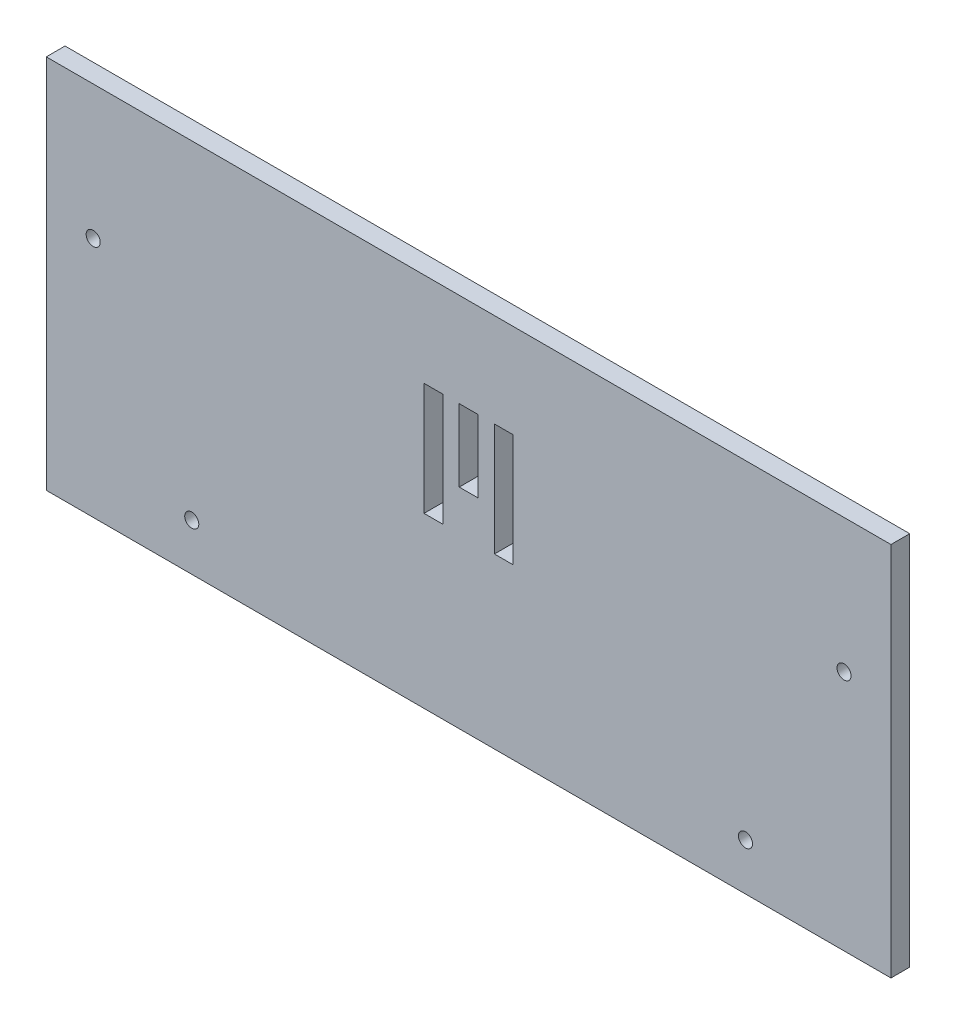
ISO-10303-21;
HEADER;
FILE_DESCRIPTION(('STEP AP214'),'2;1');
FILE_NAME('part.step','',(''),(''),'','','');
FILE_SCHEMA(('AUTOMOTIVE_DESIGN { 1 0 10303 214 1 1 1 1 }'));
ENDSEC;
DATA;
#1=APPLICATION_CONTEXT('core data for automotive mechanical design processes');
#2=APPLICATION_PROTOCOL_DEFINITION('international standard','automotive_design',2000,#1);
#3=PRODUCT_CONTEXT('',#1,'mechanical');
#4=PRODUCT('Part','Part','',(#3));
#5=PRODUCT_RELATED_PRODUCT_CATEGORY('part','',(#4));
#6=PRODUCT_DEFINITION_FORMATION('','',#4);
#7=PRODUCT_DEFINITION_CONTEXT('part definition',#1,'design');
#8=PRODUCT_DEFINITION('design','',#6,#7);
#9=PRODUCT_DEFINITION_SHAPE('','',#8);
#10=(LENGTH_UNIT() NAMED_UNIT(*) SI_UNIT(.MILLI.,.METRE.));
#11=(NAMED_UNIT(*) PLANE_ANGLE_UNIT() SI_UNIT($,.RADIAN.));
#12=(NAMED_UNIT(*) SI_UNIT($,.STERADIAN.) SOLID_ANGLE_UNIT());
#13=UNCERTAINTY_MEASURE_WITH_UNIT(LENGTH_MEASURE(1.E-05),#10,'distance_accuracy_value','');
#14=(GEOMETRIC_REPRESENTATION_CONTEXT(3) GLOBAL_UNCERTAINTY_ASSIGNED_CONTEXT((#13)) GLOBAL_UNIT_ASSIGNED_CONTEXT((#10,
#11,#12)) REPRESENTATION_CONTEXT('',''));
#15=CARTESIAN_POINT('',(0.,0.,0.));
#16=DIRECTION('',(0.,0.,1.));
#17=DIRECTION('',(1.,0.,0.));
#18=AXIS2_PLACEMENT_3D('',#15,#16,#17);
#19=CARTESIAN_POINT('',(0.,0.,4.));
#20=DIRECTION('',(0.,0.,1.));
#21=DIRECTION('',(1.,0.,0.));
#22=AXIS2_PLACEMENT_3D('',#19,#20,#21);
#23=PLANE('',#22);
#24=DIRECTION('',(0.,-1.,0.));
#25=VECTOR('',#24,1.);
#26=CARTESIAN_POINT('',(8.20064205457466,-1.11712598425197,4.));
#27=LINE('',#26,#25);
#28=CARTESIAN_POINT('',(8.20064205457466,-1.11712598425197,4.));
#29=VERTEX_POINT('',#28);
#30=CARTESIAN_POINT('',(8.20064205457466,-25.117125984252,4.));
#31=VERTEX_POINT('',#30);
#32=EDGE_CURVE('E48',#29,#31,#27,.T.);
#33=ORIENTED_EDGE('',*,*,#32,.F.);
#34=DIRECTION('',(-1.,0.,0.));
#35=VECTOR('',#34,1.);
#36=CARTESIAN_POINT('',(8.20064205457466,-1.11712598425197,4.));
#37=LINE('',#36,#35);
#38=CARTESIAN_POINT('',(12.2006420545746,-1.11712598425197,4.));
#39=VERTEX_POINT('',#38);
#40=EDGE_CURVE('E164',#39,#29,#37,.T.);
#41=ORIENTED_EDGE('',*,*,#40,.F.);
#42=DIRECTION('',(0.,1.,0.));
#43=VECTOR('',#42,1.);
#44=CARTESIAN_POINT('',(12.2006420545746,-1.11712598425197,4.));
#45=LINE('',#44,#43);
#46=CARTESIAN_POINT('',(12.2006420545746,-25.117125984252,4.));
#47=VERTEX_POINT('',#46);
#48=EDGE_CURVE('E167',#47,#39,#45,.T.);
#49=ORIENTED_EDGE('',*,*,#48,.F.);
#50=DIRECTION('',(1.,0.,0.));
#51=VECTOR('',#50,1.);
#52=CARTESIAN_POINT('',(8.20064205457466,-25.117125984252,4.));
#53=LINE('',#52,#51);
#54=EDGE_CURVE('E173',#31,#47,#53,.T.);
#55=ORIENTED_EDGE('',*,*,#54,.F.);
#56=EDGE_LOOP('',(#33,#41,#49,#55));
#57=FACE_BOUND('',#56,.T.);
#58=DIRECTION('',(0.,-1.,0.));
#59=VECTOR('',#58,1.);
#60=CARTESIAN_POINT('',(0.700642054574652,-1.11712598425197,4.));
#61=LINE('',#60,#59);
#62=CARTESIAN_POINT('',(0.700642054574652,-1.11712598425197,4.));
#63=VERTEX_POINT('',#62);
#64=CARTESIAN_POINT('',(0.700642054574654,-16.517125984252,4.));
#65=VERTEX_POINT('',#64);
#66=EDGE_CURVE('E179',#63,#65,#61,.T.);
#67=ORIENTED_EDGE('',*,*,#66,.F.);
#68=DIRECTION('',(-1.,0.,0.));
#69=VECTOR('',#68,1.);
#70=CARTESIAN_POINT('',(0.700642054574652,-1.11712598425197,4.));
#71=LINE('',#70,#69);
#72=CARTESIAN_POINT('',(4.70064205457464,-1.11712598425197,4.));
#73=VERTEX_POINT('',#72);
#74=EDGE_CURVE('E187',#73,#63,#71,.T.);
#75=ORIENTED_EDGE('',*,*,#74,.F.);
#76=DIRECTION('',(0.,1.,0.));
#77=VECTOR('',#76,1.);
#78=CARTESIAN_POINT('',(4.70064205457464,-1.11712598425197,4.));
#79=LINE('',#78,#77);
#80=CARTESIAN_POINT('',(4.70064205457464,-16.517125984252,4.));
#81=VERTEX_POINT('',#80);
#82=EDGE_CURVE('E201',#81,#73,#79,.T.);
#83=ORIENTED_EDGE('',*,*,#82,.F.);
#84=DIRECTION('',(1.,0.,0.));
#85=VECTOR('',#84,1.);
#86=CARTESIAN_POINT('',(0.700642054574654,-16.517125984252,4.));
#87=LINE('',#86,#85);
#88=EDGE_CURVE('E198',#65,#81,#87,.T.);
#89=ORIENTED_EDGE('',*,*,#88,.F.);
#90=EDGE_LOOP('',(#67,#75,#83,#89));
#91=FACE_BOUND('',#90,.T.);
#92=DIRECTION('',(0.,-1.,0.));
#93=VECTOR('',#92,1.);
#94=CARTESIAN_POINT('',(-6.79935794542534,-1.11712598425197,4.));
#95=LINE('',#94,#93);
#96=CARTESIAN_POINT('',(-6.79935794542534,-1.11712598425197,4.));
#97=VERTEX_POINT('',#96);
#98=CARTESIAN_POINT('',(-6.79935794542534,-25.117125984252,4.));
#99=VERTEX_POINT('',#98);
#100=EDGE_CURVE('E208',#97,#99,#95,.T.);
#101=ORIENTED_EDGE('',*,*,#100,.F.);
#102=DIRECTION('',(-1.,0.,0.));
#103=VECTOR('',#102,1.);
#104=CARTESIAN_POINT('',(-6.79935794542534,-1.11712598425197,4.));
#105=LINE('',#104,#103);
#106=CARTESIAN_POINT('',(-2.79935794542536,-1.11712598425197,4.));
#107=VERTEX_POINT('',#106);
#108=EDGE_CURVE('E219',#107,#97,#105,.T.);
#109=ORIENTED_EDGE('',*,*,#108,.F.);
#110=DIRECTION('',(0.,1.,0.));
#111=VECTOR('',#110,1.);
#112=CARTESIAN_POINT('',(-2.79935794542536,-1.11712598425197,4.));
#113=LINE('',#112,#111);
#114=CARTESIAN_POINT('',(-2.79935794542536,-25.117125984252,4.));
#115=VERTEX_POINT('',#114);
#116=EDGE_CURVE('E233',#115,#107,#113,.T.);
#117=ORIENTED_EDGE('',*,*,#116,.F.);
#118=DIRECTION('',(1.,0.,0.));
#119=VECTOR('',#118,1.);
#120=CARTESIAN_POINT('',(-6.79935794542534,-25.117125984252,4.));
#121=LINE('',#120,#119);
#122=EDGE_CURVE('E230',#99,#115,#121,.T.);
#123=ORIENTED_EDGE('',*,*,#122,.F.);
#124=EDGE_LOOP('',(#101,#109,#117,#123));
#125=FACE_BOUND('',#124,.T.);
#126=CARTESIAN_POINT('',(61.7006420545747,-51.117125984252,4.));
#127=DIRECTION('',(0.,0.,1.));
#128=DIRECTION('',(1.,0.,0.));
#129=AXIS2_PLACEMENT_3D('',#126,#127,#128);
#130=CIRCLE('',#129,1.5);
#131=CARTESIAN_POINT('',(63.2006420545747,-51.117125984252,4.));
#132=VERTEX_POINT('',#131);
#133=EDGE_CURVE('E253',#132,#132,#130,.T.);
#134=ORIENTED_EDGE('',*,*,#133,.F.);
#135=EDGE_LOOP('',(#134));
#136=FACE_BOUND('',#135,.T.);
#137=CARTESIAN_POINT('',(-77.2993579454253,-9.61712598425197,4.));
#138=DIRECTION('',(0.,0.,1.));
#139=DIRECTION('',(1.,0.,0.));
#140=AXIS2_PLACEMENT_3D('',#137,#138,#139);
#141=CIRCLE('',#140,1.5);
#142=CARTESIAN_POINT('',(-75.7993579454253,-9.61712598425197,4.));
#143=VERTEX_POINT('',#142);
#144=EDGE_CURVE('E265',#143,#143,#141,.T.);
#145=ORIENTED_EDGE('',*,*,#144,.F.);
#146=EDGE_LOOP('',(#145));
#147=FACE_BOUND('',#146,.T.);
#148=DIRECTION('',(0.,-1.,0.));
#149=VECTOR('',#148,1.);
#150=CARTESIAN_POINT('',(-87.2993579454253,18.882874015748,4.));
#151=LINE('',#150,#149);
#152=CARTESIAN_POINT('',(-87.2993579454253,18.882874015748,4.));
#153=VERTEX_POINT('',#152);
#154=CARTESIAN_POINT('',(-87.2993579454253,-61.117125984252,4.));
#155=VERTEX_POINT('',#154);
#156=EDGE_CURVE('E271',#153,#155,#151,.T.);
#157=ORIENTED_EDGE('',*,*,#156,.T.);
#158=DIRECTION('',(1.,0.,0.));
#159=VECTOR('',#158,1.);
#160=CARTESIAN_POINT('',(-87.2993579454253,-61.117125984252,4.));
#161=LINE('',#160,#159);
#162=CARTESIAN_POINT('',(92.7006420545746,-61.117125984252,4.));
#163=VERTEX_POINT('',#162);
#164=EDGE_CURVE('E274',#155,#163,#161,.T.);
#165=ORIENTED_EDGE('',*,*,#164,.T.);
#166=DIRECTION('',(0.,1.,0.));
#167=VECTOR('',#166,1.);
#168=CARTESIAN_POINT('',(92.7006420545746,18.882874015748,4.));
#169=LINE('',#168,#167);
#170=CARTESIAN_POINT('',(92.7006420545746,18.882874015748,4.));
#171=VERTEX_POINT('',#170);
#172=EDGE_CURVE('E277',#163,#171,#169,.T.);
#173=ORIENTED_EDGE('',*,*,#172,.T.);
#174=DIRECTION('',(-1.,0.,0.));
#175=VECTOR('',#174,1.);
#176=CARTESIAN_POINT('',(-87.2993579454253,18.882874015748,4.));
#177=LINE('',#176,#175);
#178=EDGE_CURVE('E279',#171,#153,#177,.T.);
#179=ORIENTED_EDGE('',*,*,#178,.T.);
#180=EDGE_LOOP('',(#157,#165,#173,#179));
#181=FACE_BOUND('',#180,.T.);
#182=CARTESIAN_POINT('',(82.7006420545746,-9.61712598425197,4.));
#183=DIRECTION('',(0.,0.,1.));
#184=DIRECTION('',(1.,0.,0.));
#185=AXIS2_PLACEMENT_3D('',#182,#183,#184);
#186=CIRCLE('',#185,1.49999999999998);
#187=CARTESIAN_POINT('',(84.2006420545746,-9.61712598425197,4.));
#188=VERTEX_POINT('',#187);
#189=EDGE_CURVE('E259',#188,#188,#186,.T.);
#190=ORIENTED_EDGE('',*,*,#189,.F.);
#191=EDGE_LOOP('',(#190));
#192=FACE_BOUND('',#191,.T.);
#193=CARTESIAN_POINT('',(-56.2993579454253,-51.117125984252,4.));
#194=DIRECTION('',(0.,0.,1.));
#195=DIRECTION('',(1.,0.,0.));
#196=AXIS2_PLACEMENT_3D('',#193,#194,#195);
#197=CIRCLE('',#196,1.5);
#198=CARTESIAN_POINT('',(-54.7993579454253,-51.117125984252,4.));
#199=VERTEX_POINT('',#198);
#200=EDGE_CURVE('E247',#199,#199,#197,.T.);
#201=ORIENTED_EDGE('',*,*,#200,.F.);
#202=EDGE_LOOP('',(#201));
#203=FACE_BOUND('',#202,.T.);
#204=ADVANCED_FACE('F33',(#57,#91,#125,#136,#147,#181,#192,#203),#23,.T.);
#205=CARTESIAN_POINT('',(0.,0.,0.));
#206=DIRECTION('',(0.,0.,1.));
#207=DIRECTION('',(1.,0.,0.));
#208=AXIS2_PLACEMENT_3D('',#205,#206,#207);
#209=PLANE('',#208);
#210=DIRECTION('',(-1.,0.,0.));
#211=VECTOR('',#210,1.);
#212=CARTESIAN_POINT('',(8.20064205457466,-1.11712598425197,0.));
#213=LINE('',#212,#211);
#214=CARTESIAN_POINT('',(12.2006420545746,-1.11712598425197,0.));
#215=VERTEX_POINT('',#214);
#216=CARTESIAN_POINT('',(8.20064205457466,-1.11712598425197,0.));
#217=VERTEX_POINT('',#216);
#218=EDGE_CURVE('E154',#215,#217,#213,.T.);
#219=ORIENTED_EDGE('',*,*,#218,.T.);
#220=DIRECTION('',(0.,-1.,0.));
#221=VECTOR('',#220,1.);
#222=CARTESIAN_POINT('',(8.20064205457466,-1.11712598425197,0.));
#223=LINE('',#222,#221);
#224=CARTESIAN_POINT('',(8.20064205457466,-25.117125984252,0.));
#225=VERTEX_POINT('',#224);
#226=EDGE_CURVE('E148',#217,#225,#223,.T.);
#227=ORIENTED_EDGE('',*,*,#226,.T.);
#228=DIRECTION('',(1.,0.,0.));
#229=VECTOR('',#228,1.);
#230=CARTESIAN_POINT('',(8.20064205457466,-25.117125984252,0.));
#231=LINE('',#230,#229);
#232=CARTESIAN_POINT('',(12.2006420545746,-25.117125984252,0.));
#233=VERTEX_POINT('',#232);
#234=EDGE_CURVE('E157',#225,#233,#231,.T.);
#235=ORIENTED_EDGE('',*,*,#234,.T.);
#236=DIRECTION('',(0.,1.,0.));
#237=VECTOR('',#236,1.);
#238=CARTESIAN_POINT('',(12.2006420545746,-1.11712598425197,0.));
#239=LINE('',#238,#237);
#240=EDGE_CURVE('E56',#233,#215,#239,.T.);
#241=ORIENTED_EDGE('',*,*,#240,.T.);
#242=EDGE_LOOP('',(#219,#227,#235,#241));
#243=FACE_BOUND('',#242,.T.);
#244=DIRECTION('',(-1.,0.,0.));
#245=VECTOR('',#244,1.);
#246=CARTESIAN_POINT('',(0.700642054574652,-1.11712598425197,0.));
#247=LINE('',#246,#245);
#248=CARTESIAN_POINT('',(4.70064205457464,-1.11712598425197,0.));
#249=VERTEX_POINT('',#248);
#250=CARTESIAN_POINT('',(0.700642054574652,-1.11712598425197,0.));
#251=VERTEX_POINT('',#250);
#252=EDGE_CURVE('E193',#249,#251,#247,.T.);
#253=ORIENTED_EDGE('',*,*,#252,.T.);
#254=DIRECTION('',(0.,-1.,0.));
#255=VECTOR('',#254,1.);
#256=CARTESIAN_POINT('',(0.700642054574652,-1.11712598425197,0.));
#257=LINE('',#256,#255);
#258=CARTESIAN_POINT('',(0.700642054574654,-16.517125984252,0.));
#259=VERTEX_POINT('',#258);
#260=EDGE_CURVE('E183',#251,#259,#257,.T.);
#261=ORIENTED_EDGE('',*,*,#260,.T.);
#262=DIRECTION('',(1.,0.,0.));
#263=VECTOR('',#262,1.);
#264=CARTESIAN_POINT('',(0.700642054574654,-16.517125984252,0.));
#265=LINE('',#264,#263);
#266=CARTESIAN_POINT('',(4.70064205457464,-16.517125984252,0.));
#267=VERTEX_POINT('',#266);
#268=EDGE_CURVE('E186',#259,#267,#265,.T.);
#269=ORIENTED_EDGE('',*,*,#268,.T.);
#270=DIRECTION('',(0.,1.,0.));
#271=VECTOR('',#270,1.);
#272=CARTESIAN_POINT('',(4.70064205457464,-1.11712598425197,0.));
#273=LINE('',#272,#271);
#274=EDGE_CURVE('E190',#267,#249,#273,.T.);
#275=ORIENTED_EDGE('',*,*,#274,.T.);
#276=EDGE_LOOP('',(#253,#261,#269,#275));
#277=FACE_BOUND('',#276,.T.);
#278=DIRECTION('',(-1.,0.,0.));
#279=VECTOR('',#278,1.);
#280=CARTESIAN_POINT('',(-6.79935794542534,-1.11712598425197,0.));
#281=LINE('',#280,#279);
#282=CARTESIAN_POINT('',(-2.79935794542536,-1.11712598425197,0.));
#283=VERTEX_POINT('',#282);
#284=CARTESIAN_POINT('',(-6.79935794542534,-1.11712598425197,0.));
#285=VERTEX_POINT('',#284);
#286=EDGE_CURVE('E225',#283,#285,#281,.T.);
#287=ORIENTED_EDGE('',*,*,#286,.T.);
#288=DIRECTION('',(0.,-1.,0.));
#289=VECTOR('',#288,1.);
#290=CARTESIAN_POINT('',(-6.79935794542534,-1.11712598425197,0.));
#291=LINE('',#290,#289);
#292=CARTESIAN_POINT('',(-6.79935794542534,-25.117125984252,0.));
#293=VERTEX_POINT('',#292);
#294=EDGE_CURVE('E215',#285,#293,#291,.T.);
#295=ORIENTED_EDGE('',*,*,#294,.T.);
#296=DIRECTION('',(1.,0.,0.));
#297=VECTOR('',#296,1.);
#298=CARTESIAN_POINT('',(-6.79935794542534,-25.117125984252,0.));
#299=LINE('',#298,#297);
#300=CARTESIAN_POINT('',(-2.79935794542536,-25.117125984252,0.));
#301=VERTEX_POINT('',#300);
#302=EDGE_CURVE('E218',#293,#301,#299,.T.);
#303=ORIENTED_EDGE('',*,*,#302,.T.);
#304=DIRECTION('',(0.,1.,0.));
#305=VECTOR('',#304,1.);
#306=CARTESIAN_POINT('',(-2.79935794542536,-1.11712598425197,0.));
#307=LINE('',#306,#305);
#308=EDGE_CURVE('E222',#301,#283,#307,.T.);
#309=ORIENTED_EDGE('',*,*,#308,.T.);
#310=EDGE_LOOP('',(#287,#295,#303,#309));
#311=FACE_BOUND('',#310,.T.);
#312=DIRECTION('',(0.,-1.,0.));
#313=VECTOR('',#312,1.);
#314=CARTESIAN_POINT('',(-87.2993579454253,18.882874015748,0.));
#315=LINE('',#314,#313);
#316=CARTESIAN_POINT('',(-87.2993579454253,18.882874015748,0.));
#317=VERTEX_POINT('',#316);
#318=CARTESIAN_POINT('',(-87.2993579454253,-61.117125984252,0.));
#319=VERTEX_POINT('',#318);
#320=EDGE_CURVE('E268',#317,#319,#315,.T.);
#321=ORIENTED_EDGE('',*,*,#320,.F.);
#322=DIRECTION('',(-1.,0.,0.));
#323=VECTOR('',#322,1.);
#324=CARTESIAN_POINT('',(-87.2993579454253,18.882874015748,0.));
#325=LINE('',#324,#323);
#326=CARTESIAN_POINT('',(92.7006420545746,18.882874015748,0.));
#327=VERTEX_POINT('',#326);
#328=EDGE_CURVE('E275',#327,#317,#325,.T.);
#329=ORIENTED_EDGE('',*,*,#328,.F.);
#330=DIRECTION('',(0.,1.,0.));
#331=VECTOR('',#330,1.);
#332=CARTESIAN_POINT('',(92.7006420545746,18.882874015748,0.));
#333=LINE('',#332,#331);
#334=CARTESIAN_POINT('',(92.7006420545746,-61.117125984252,0.));
#335=VERTEX_POINT('',#334);
#336=EDGE_CURVE('E286',#335,#327,#333,.T.);
#337=ORIENTED_EDGE('',*,*,#336,.F.);
#338=DIRECTION('',(1.,0.,0.));
#339=VECTOR('',#338,1.);
#340=CARTESIAN_POINT('',(-87.2993579454253,-61.117125984252,0.));
#341=LINE('',#340,#339);
#342=EDGE_CURVE('E284',#319,#335,#341,.T.);
#343=ORIENTED_EDGE('',*,*,#342,.F.);
#344=EDGE_LOOP('',(#321,#329,#337,#343));
#345=FACE_BOUND('',#344,.T.);
#346=CARTESIAN_POINT('',(-77.2993579454253,-9.61712598425197,0.));
#347=DIRECTION('',(0.,0.,1.));
#348=DIRECTION('',(1.,0.,0.));
#349=AXIS2_PLACEMENT_3D('',#346,#347,#348);
#350=CIRCLE('',#349,1.5);
#351=CARTESIAN_POINT('',(-75.7993579454253,-9.61712598425197,0.));
#352=VERTEX_POINT('',#351);
#353=EDGE_CURVE('E262',#352,#352,#350,.T.);
#354=ORIENTED_EDGE('',*,*,#353,.T.);
#355=EDGE_LOOP('',(#354));
#356=FACE_BOUND('',#355,.T.);
#357=CARTESIAN_POINT('',(82.7006420545746,-9.61712598425197,0.));
#358=DIRECTION('',(0.,0.,1.));
#359=DIRECTION('',(1.,0.,0.));
#360=AXIS2_PLACEMENT_3D('',#357,#358,#359);
#361=CIRCLE('',#360,1.49999999999998);
#362=CARTESIAN_POINT('',(84.2006420545746,-9.61712598425197,0.));
#363=VERTEX_POINT('',#362);
#364=EDGE_CURVE('E256',#363,#363,#361,.T.);
#365=ORIENTED_EDGE('',*,*,#364,.T.);
#366=EDGE_LOOP('',(#365));
#367=FACE_BOUND('',#366,.T.);
#368=CARTESIAN_POINT('',(61.7006420545747,-51.117125984252,0.));
#369=DIRECTION('',(0.,0.,1.));
#370=DIRECTION('',(1.,0.,0.));
#371=AXIS2_PLACEMENT_3D('',#368,#369,#370);
#372=CIRCLE('',#371,1.5);
#373=CARTESIAN_POINT('',(63.2006420545747,-51.117125984252,0.));
#374=VERTEX_POINT('',#373);
#375=EDGE_CURVE('E250',#374,#374,#372,.T.);
#376=ORIENTED_EDGE('',*,*,#375,.T.);
#377=EDGE_LOOP('',(#376));
#378=FACE_BOUND('',#377,.T.);
#379=CARTESIAN_POINT('',(-56.2993579454253,-51.117125984252,0.));
#380=DIRECTION('',(0.,0.,1.));
#381=DIRECTION('',(1.,0.,0.));
#382=AXIS2_PLACEMENT_3D('',#379,#380,#381);
#383=CIRCLE('',#382,1.5);
#384=CARTESIAN_POINT('',(-54.7993579454253,-51.117125984252,0.));
#385=VERTEX_POINT('',#384);
#386=EDGE_CURVE('E240',#385,#385,#383,.T.);
#387=ORIENTED_EDGE('',*,*,#386,.T.);
#388=EDGE_LOOP('',(#387));
#389=FACE_BOUND('',#388,.T.);
#390=ADVANCED_FACE('F161',(#243,#277,#311,#345,#356,#367,#378,#389),#209,.F.);
#391=CARTESIAN_POINT('',(-87.2993579454253,18.882874015748,4.));
#392=DIRECTION('',(1.,0.,0.));
#393=DIRECTION('',(0.,1.,0.));
#394=AXIS2_PLACEMENT_3D('',#391,#392,#393);
#395=PLANE('',#394);
#396=ORIENTED_EDGE('',*,*,#320,.T.);
#397=DIRECTION('',(0.,0.,-1.));
#398=VECTOR('',#397,1.);
#399=CARTESIAN_POINT('',(-87.2993579454253,-61.117125984252,4.));
#400=LINE('',#399,#398);
#401=EDGE_CURVE('E11',#155,#319,#400,.T.);
#402=ORIENTED_EDGE('',*,*,#401,.F.);
#403=ORIENTED_EDGE('',*,*,#156,.F.);
#404=DIRECTION('',(0.,0.,-1.));
#405=VECTOR('',#404,1.);
#406=CARTESIAN_POINT('',(-87.2993579454253,18.882874015748,4.));
#407=LINE('',#406,#405);
#408=EDGE_CURVE('E281',#153,#317,#407,.T.);
#409=ORIENTED_EDGE('',*,*,#408,.T.);
#410=EDGE_LOOP('',(#396,#402,#403,#409));
#411=FACE_BOUND('',#410,.T.);
#412=ADVANCED_FACE('F35',(#411),#395,.F.);
#413=CARTESIAN_POINT('',(-87.2993579454253,-61.117125984252,4.));
#414=DIRECTION('',(0.,1.,0.));
#415=DIRECTION('',(0.,0.,1.));
#416=AXIS2_PLACEMENT_3D('',#413,#414,#415);
#417=PLANE('',#416);
#418=ORIENTED_EDGE('',*,*,#342,.T.);
#419=DIRECTION('',(0.,0.,-1.));
#420=VECTOR('',#419,1.);
#421=CARTESIAN_POINT('',(92.7006420545746,-61.117125984252,4.));
#422=LINE('',#421,#420);
#423=EDGE_CURVE('E41',#163,#335,#422,.T.);
#424=ORIENTED_EDGE('',*,*,#423,.F.);
#425=ORIENTED_EDGE('',*,*,#164,.F.);
#426=ORIENTED_EDGE('',*,*,#401,.T.);
#427=EDGE_LOOP('',(#418,#424,#425,#426));
#428=FACE_BOUND('',#427,.T.);
#429=ADVANCED_FACE('F314',(#428),#417,.F.);
#430=CARTESIAN_POINT('',(92.7006420545746,18.882874015748,4.));
#431=DIRECTION('',(-1.,0.,0.));
#432=DIRECTION('',(0.,0.,1.));
#433=AXIS2_PLACEMENT_3D('',#430,#431,#432);
#434=PLANE('',#433);
#435=ORIENTED_EDGE('',*,*,#336,.T.);
#436=DIRECTION('',(0.,0.,-1.));
#437=VECTOR('',#436,1.);
#438=CARTESIAN_POINT('',(92.7006420545746,18.882874015748,4.));
#439=LINE('',#438,#437);
#440=EDGE_CURVE('E291',#171,#327,#439,.T.);
#441=ORIENTED_EDGE('',*,*,#440,.F.);
#442=ORIENTED_EDGE('',*,*,#172,.F.);
#443=ORIENTED_EDGE('',*,*,#423,.T.);
#444=EDGE_LOOP('',(#435,#441,#442,#443));
#445=FACE_BOUND('',#444,.T.);
#446=ADVANCED_FACE('F298',(#445),#434,.F.);
#447=CARTESIAN_POINT('',(-87.2993579454253,18.882874015748,4.));
#448=DIRECTION('',(0.,-1.,0.));
#449=DIRECTION('',(0.,0.,-1.));
#450=AXIS2_PLACEMENT_3D('',#447,#448,#449);
#451=PLANE('',#450);
#452=ORIENTED_EDGE('',*,*,#328,.T.);
#453=ORIENTED_EDGE('',*,*,#408,.F.);
#454=ORIENTED_EDGE('',*,*,#178,.F.);
#455=ORIENTED_EDGE('',*,*,#440,.T.);
#456=EDGE_LOOP('',(#452,#453,#454,#455));
#457=FACE_BOUND('',#456,.T.);
#458=ADVANCED_FACE('F307',(#457),#451,.F.);
#459=CARTESIAN_POINT('',(-77.2993579454253,-9.61712598425197,4.));
#460=DIRECTION('',(0.,0.,-1.));
#461=DIRECTION('',(-1.,0.,0.));
#462=AXIS2_PLACEMENT_3D('',#459,#460,#461);
#463=CYLINDRICAL_SURFACE('',#462,1.5);
#464=ORIENTED_EDGE('',*,*,#144,.T.);
#465=EDGE_LOOP('',(#464));
#466=FACE_BOUND('',#465,.T.);
#467=ORIENTED_EDGE('',*,*,#353,.F.);
#468=EDGE_LOOP('',(#467));
#469=FACE_BOUND('',#468,.T.);
#470=ADVANCED_FACE('F330',(#466,#469),#463,.F.);
#471=CARTESIAN_POINT('',(82.7006420545746,-9.61712598425197,4.));
#472=DIRECTION('',(0.,0.,-1.));
#473=DIRECTION('',(-1.,0.,0.));
#474=AXIS2_PLACEMENT_3D('',#471,#472,#473);
#475=CYLINDRICAL_SURFACE('',#474,1.49999999999998);
#476=ORIENTED_EDGE('',*,*,#189,.T.);
#477=EDGE_LOOP('',(#476));
#478=FACE_BOUND('',#477,.T.);
#479=ORIENTED_EDGE('',*,*,#364,.F.);
#480=EDGE_LOOP('',(#479));
#481=FACE_BOUND('',#480,.T.);
#482=ADVANCED_FACE('F337',(#478,#481),#475,.F.);
#483=CARTESIAN_POINT('',(61.7006420545747,-51.117125984252,4.));
#484=DIRECTION('',(0.,0.,-1.));
#485=DIRECTION('',(-1.,0.,0.));
#486=AXIS2_PLACEMENT_3D('',#483,#484,#485);
#487=CYLINDRICAL_SURFACE('',#486,1.5);
#488=ORIENTED_EDGE('',*,*,#133,.T.);
#489=EDGE_LOOP('',(#488));
#490=FACE_BOUND('',#489,.T.);
#491=ORIENTED_EDGE('',*,*,#375,.F.);
#492=EDGE_LOOP('',(#491));
#493=FACE_BOUND('',#492,.T.);
#494=ADVANCED_FACE('F342',(#490,#493),#487,.F.);
#495=CARTESIAN_POINT('',(-56.2993579454253,-51.117125984252,4.));
#496=DIRECTION('',(0.,0.,-1.));
#497=DIRECTION('',(-1.,0.,0.));
#498=AXIS2_PLACEMENT_3D('',#495,#496,#497);
#499=CYLINDRICAL_SURFACE('',#498,1.5);
#500=ORIENTED_EDGE('',*,*,#200,.T.);
#501=EDGE_LOOP('',(#500));
#502=FACE_BOUND('',#501,.T.);
#503=ORIENTED_EDGE('',*,*,#386,.F.);
#504=EDGE_LOOP('',(#503));
#505=FACE_BOUND('',#504,.T.);
#506=ADVANCED_FACE('F354',(#502,#505),#499,.F.);
#507=CARTESIAN_POINT('',(-6.79935794542534,-1.11712598425197,0.));
#508=DIRECTION('',(-1.,0.,0.));
#509=DIRECTION('',(0.,-1.,0.));
#510=AXIS2_PLACEMENT_3D('',#507,#508,#509);
#511=PLANE('',#510);
#512=ORIENTED_EDGE('',*,*,#100,.T.);
#513=DIRECTION('',(0.,0.,1.));
#514=VECTOR('',#513,1.);
#515=CARTESIAN_POINT('',(-6.79935794542534,-25.117125984252,0.));
#516=LINE('',#515,#514);
#517=EDGE_CURVE('E228',#293,#99,#516,.T.);
#518=ORIENTED_EDGE('',*,*,#517,.F.);
#519=ORIENTED_EDGE('',*,*,#294,.F.);
#520=DIRECTION('',(0.,0.,1.));
#521=VECTOR('',#520,1.);
#522=CARTESIAN_POINT('',(-6.79935794542534,-1.11712598425197,0.));
#523=LINE('',#522,#521);
#524=EDGE_CURVE('E238',#285,#97,#523,.T.);
#525=ORIENTED_EDGE('',*,*,#524,.T.);
#526=EDGE_LOOP('',(#512,#518,#519,#525));
#527=FACE_BOUND('',#526,.T.);
#528=ADVANCED_FACE('F356',(#527),#511,.F.);
#529=CARTESIAN_POINT('',(-6.79935794542534,-1.11712598425197,0.));
#530=DIRECTION('',(0.,1.,0.));
#531=DIRECTION('',(0.,0.,1.));
#532=AXIS2_PLACEMENT_3D('',#529,#530,#531);
#533=PLANE('',#532);
#534=ORIENTED_EDGE('',*,*,#108,.T.);
#535=ORIENTED_EDGE('',*,*,#524,.F.);
#536=ORIENTED_EDGE('',*,*,#286,.F.);
#537=DIRECTION('',(0.,0.,1.));
#538=VECTOR('',#537,1.);
#539=CARTESIAN_POINT('',(-2.79935794542536,-1.11712598425197,0.));
#540=LINE('',#539,#538);
#541=EDGE_CURVE('E241',#283,#107,#540,.T.);
#542=ORIENTED_EDGE('',*,*,#541,.T.);
#543=EDGE_LOOP('',(#534,#535,#536,#542));
#544=FACE_BOUND('',#543,.T.);
#545=ADVANCED_FACE('F363',(#544),#533,.F.);
#546=CARTESIAN_POINT('',(-2.79935794542536,-1.11712598425197,0.));
#547=DIRECTION('',(1.,0.,0.));
#548=DIRECTION('',(0.,1.,0.));
#549=AXIS2_PLACEMENT_3D('',#546,#547,#548);
#550=PLANE('',#549);
#551=ORIENTED_EDGE('',*,*,#116,.T.);
#552=ORIENTED_EDGE('',*,*,#541,.F.);
#553=ORIENTED_EDGE('',*,*,#308,.F.);
#554=DIRECTION('',(0.,0.,1.));
#555=VECTOR('',#554,1.);
#556=CARTESIAN_POINT('',(-2.79935794542536,-25.117125984252,0.));
#557=LINE('',#556,#555);
#558=EDGE_CURVE('E243',#301,#115,#557,.T.);
#559=ORIENTED_EDGE('',*,*,#558,.T.);
#560=EDGE_LOOP('',(#551,#552,#553,#559));
#561=FACE_BOUND('',#560,.T.);
#562=ADVANCED_FACE('F373',(#561),#550,.F.);
#563=CARTESIAN_POINT('',(-6.79935794542534,-25.117125984252,0.));
#564=DIRECTION('',(0.,-1.,0.));
#565=DIRECTION('',(1.,0.,0.));
#566=AXIS2_PLACEMENT_3D('',#563,#564,#565);
#567=PLANE('',#566);
#568=ORIENTED_EDGE('',*,*,#122,.T.);
#569=ORIENTED_EDGE('',*,*,#558,.F.);
#570=ORIENTED_EDGE('',*,*,#302,.F.);
#571=ORIENTED_EDGE('',*,*,#517,.T.);
#572=EDGE_LOOP('',(#568,#569,#570,#571));
#573=FACE_BOUND('',#572,.T.);
#574=ADVANCED_FACE('F369',(#573),#567,.F.);
#575=CARTESIAN_POINT('',(0.700642054574652,-1.11712598425197,0.));
#576=DIRECTION('',(-1.,0.,0.));
#577=DIRECTION('',(0.,-1.,0.));
#578=AXIS2_PLACEMENT_3D('',#575,#576,#577);
#579=PLANE('',#578);
#580=ORIENTED_EDGE('',*,*,#66,.T.);
#581=DIRECTION('',(0.,0.,1.));
#582=VECTOR('',#581,1.);
#583=CARTESIAN_POINT('',(0.700642054574654,-16.517125984252,0.));
#584=LINE('',#583,#582);
#585=EDGE_CURVE('E196',#259,#65,#584,.T.);
#586=ORIENTED_EDGE('',*,*,#585,.F.);
#587=ORIENTED_EDGE('',*,*,#260,.F.);
#588=DIRECTION('',(0.,0.,1.));
#589=VECTOR('',#588,1.);
#590=CARTESIAN_POINT('',(0.700642054574652,-1.11712598425197,0.));
#591=LINE('',#590,#589);
#592=EDGE_CURVE('E206',#251,#63,#591,.T.);
#593=ORIENTED_EDGE('',*,*,#592,.T.);
#594=EDGE_LOOP('',(#580,#586,#587,#593));
#595=FACE_BOUND('',#594,.T.);
#596=ADVANCED_FACE('F372',(#595),#579,.F.);
#597=CARTESIAN_POINT('',(0.700642054574652,-1.11712598425197,0.));
#598=DIRECTION('',(0.,1.,0.));
#599=DIRECTION('',(0.,0.,1.));
#600=AXIS2_PLACEMENT_3D('',#597,#598,#599);
#601=PLANE('',#600);
#602=ORIENTED_EDGE('',*,*,#74,.T.);
#603=ORIENTED_EDGE('',*,*,#592,.F.);
#604=ORIENTED_EDGE('',*,*,#252,.F.);
#605=DIRECTION('',(0.,0.,1.));
#606=VECTOR('',#605,1.);
#607=CARTESIAN_POINT('',(4.70064205457464,-1.11712598425197,0.));
#608=LINE('',#607,#606);
#609=EDGE_CURVE('E209',#249,#73,#608,.T.);
#610=ORIENTED_EDGE('',*,*,#609,.T.);
#611=EDGE_LOOP('',(#602,#603,#604,#610));
#612=FACE_BOUND('',#611,.T.);
#613=ADVANCED_FACE('F383',(#612),#601,.F.);
#614=CARTESIAN_POINT('',(4.70064205457464,-1.11712598425197,0.));
#615=DIRECTION('',(1.,0.,0.));
#616=DIRECTION('',(0.,1.,0.));
#617=AXIS2_PLACEMENT_3D('',#614,#615,#616);
#618=PLANE('',#617);
#619=ORIENTED_EDGE('',*,*,#82,.T.);
#620=ORIENTED_EDGE('',*,*,#609,.F.);
#621=ORIENTED_EDGE('',*,*,#274,.F.);
#622=DIRECTION('',(0.,0.,1.));
#623=VECTOR('',#622,1.);
#624=CARTESIAN_POINT('',(4.70064205457464,-16.517125984252,0.));
#625=LINE('',#624,#623);
#626=EDGE_CURVE('E211',#267,#81,#625,.T.);
#627=ORIENTED_EDGE('',*,*,#626,.T.);
#628=EDGE_LOOP('',(#619,#620,#621,#627));
#629=FACE_BOUND('',#628,.T.);
#630=ADVANCED_FACE('F388',(#629),#618,.F.);
#631=CARTESIAN_POINT('',(0.700642054574654,-16.517125984252,0.));
#632=DIRECTION('',(0.,-1.,0.));
#633=DIRECTION('',(0.,0.,-1.));
#634=AXIS2_PLACEMENT_3D('',#631,#632,#633);
#635=PLANE('',#634);
#636=ORIENTED_EDGE('',*,*,#88,.T.);
#637=ORIENTED_EDGE('',*,*,#626,.F.);
#638=ORIENTED_EDGE('',*,*,#268,.F.);
#639=ORIENTED_EDGE('',*,*,#585,.T.);
#640=EDGE_LOOP('',(#636,#637,#638,#639));
#641=FACE_BOUND('',#640,.T.);
#642=ADVANCED_FACE('F385',(#641),#635,.F.);
#643=CARTESIAN_POINT('',(8.20064205457466,-1.11712598425197,0.));
#644=DIRECTION('',(-1.,0.,0.));
#645=DIRECTION('',(0.,-1.,0.));
#646=AXIS2_PLACEMENT_3D('',#643,#644,#645);
#647=PLANE('',#646);
#648=ORIENTED_EDGE('',*,*,#32,.T.);
#649=DIRECTION('',(0.,0.,1.));
#650=VECTOR('',#649,1.);
#651=CARTESIAN_POINT('',(8.20064205457466,-25.117125984252,0.));
#652=LINE('',#651,#650);
#653=EDGE_CURVE('E144',#225,#31,#652,.T.);
#654=ORIENTED_EDGE('',*,*,#653,.F.);
#655=ORIENTED_EDGE('',*,*,#226,.F.);
#656=DIRECTION('',(0.,0.,1.));
#657=VECTOR('',#656,1.);
#658=CARTESIAN_POINT('',(8.20064205457466,-1.11712598425197,0.));
#659=LINE('',#658,#657);
#660=EDGE_CURVE('E177',#217,#29,#659,.T.);
#661=ORIENTED_EDGE('',*,*,#660,.T.);
#662=EDGE_LOOP('',(#648,#654,#655,#661));
#663=FACE_BOUND('',#662,.T.);
#664=ADVANCED_FACE('F146',(#663),#647,.F.);
#665=CARTESIAN_POINT('',(8.20064205457466,-1.11712598425197,0.));
#666=DIRECTION('',(0.,1.,0.));
#667=DIRECTION('',(0.,0.,1.));
#668=AXIS2_PLACEMENT_3D('',#665,#666,#667);
#669=PLANE('',#668);
#670=ORIENTED_EDGE('',*,*,#40,.T.);
#671=ORIENTED_EDGE('',*,*,#660,.F.);
#672=ORIENTED_EDGE('',*,*,#218,.F.);
#673=DIRECTION('',(0.,0.,1.));
#674=VECTOR('',#673,1.);
#675=CARTESIAN_POINT('',(12.2006420545746,-1.11712598425197,0.));
#676=LINE('',#675,#674);
#677=EDGE_CURVE('E180',#215,#39,#676,.T.);
#678=ORIENTED_EDGE('',*,*,#677,.T.);
#679=EDGE_LOOP('',(#670,#671,#672,#678));
#680=FACE_BOUND('',#679,.T.);
#681=ADVANCED_FACE('F398',(#680),#669,.F.);
#682=CARTESIAN_POINT('',(12.2006420545746,-1.11712598425197,0.));
#683=DIRECTION('',(1.,0.,0.));
#684=DIRECTION('',(0.,1.,0.));
#685=AXIS2_PLACEMENT_3D('',#682,#683,#684);
#686=PLANE('',#685);
#687=ORIENTED_EDGE('',*,*,#48,.T.);
#688=ORIENTED_EDGE('',*,*,#677,.F.);
#689=ORIENTED_EDGE('',*,*,#240,.F.);
#690=DIRECTION('',(0.,0.,1.));
#691=VECTOR('',#690,1.);
#692=CARTESIAN_POINT('',(12.2006420545746,-25.117125984252,0.));
#693=LINE('',#692,#691);
#694=EDGE_CURVE('E153',#233,#47,#693,.T.);
#695=ORIENTED_EDGE('',*,*,#694,.T.);
#696=EDGE_LOOP('',(#687,#688,#689,#695));
#697=FACE_BOUND('',#696,.T.);
#698=ADVANCED_FACE('F401',(#697),#686,.F.);
#699=CARTESIAN_POINT('',(8.20064205457466,-25.117125984252,0.));
#700=DIRECTION('',(0.,-1.,0.));
#701=DIRECTION('',(1.,0.,0.));
#702=AXIS2_PLACEMENT_3D('',#699,#700,#701);
#703=PLANE('',#702);
#704=ORIENTED_EDGE('',*,*,#54,.T.);
#705=ORIENTED_EDGE('',*,*,#694,.F.);
#706=ORIENTED_EDGE('',*,*,#234,.F.);
#707=ORIENTED_EDGE('',*,*,#653,.T.);
#708=EDGE_LOOP('',(#704,#705,#706,#707));
#709=FACE_BOUND('',#708,.T.);
#710=ADVANCED_FACE('F158',(#709),#703,.F.);
#711=CLOSED_SHELL('',(#204,#390,#412,#429,#446,#458,#470,#482,#494,#506,#528,#545,#562,#574,
#596,#613,#630,#642,#664,#681,#698,#710));
#712=MANIFOLD_SOLID_BREP('B2',#711);
#713=ADVANCED_BREP_SHAPE_REPRESENTATION('',(#18,#712),#14);
#714=SHAPE_DEFINITION_REPRESENTATION(#9,#713);
ENDSEC;
END-ISO-10303-21;
